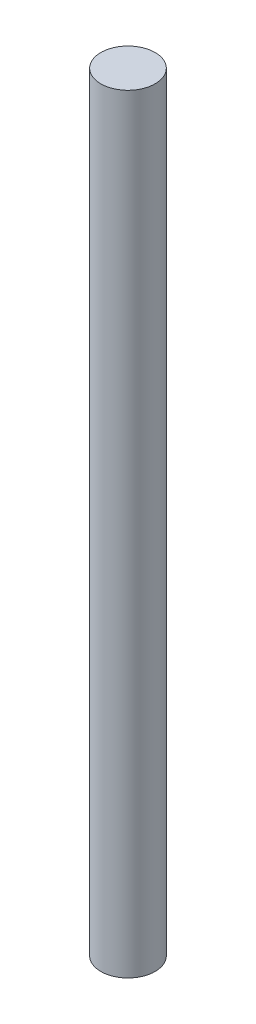
ISO-10303-21;
HEADER;
FILE_DESCRIPTION(('STEP AP214'),'2;1');
FILE_NAME('part.step','',(''),(''),'','','');
FILE_SCHEMA(('AUTOMOTIVE_DESIGN { 1 0 10303 214 1 1 1 1 }'));
ENDSEC;
DATA;
#1=APPLICATION_CONTEXT('core data for automotive mechanical design processes');
#2=APPLICATION_PROTOCOL_DEFINITION('international standard','automotive_design',2000,#1);
#3=PRODUCT_CONTEXT('',#1,'mechanical');
#4=PRODUCT('Part','Part','',(#3));
#5=PRODUCT_RELATED_PRODUCT_CATEGORY('part','',(#4));
#6=PRODUCT_DEFINITION_FORMATION('','',#4);
#7=PRODUCT_DEFINITION_CONTEXT('part definition',#1,'design');
#8=PRODUCT_DEFINITION('design','',#6,#7);
#9=PRODUCT_DEFINITION_SHAPE('','',#8);
#10=(LENGTH_UNIT() NAMED_UNIT(*) SI_UNIT(.MILLI.,.METRE.));
#11=(NAMED_UNIT(*) PLANE_ANGLE_UNIT() SI_UNIT($,.RADIAN.));
#12=(NAMED_UNIT(*) SI_UNIT($,.STERADIAN.) SOLID_ANGLE_UNIT());
#13=UNCERTAINTY_MEASURE_WITH_UNIT(LENGTH_MEASURE(1.E-05),#10,'distance_accuracy_value','');
#14=(GEOMETRIC_REPRESENTATION_CONTEXT(3) GLOBAL_UNCERTAINTY_ASSIGNED_CONTEXT((#13)) GLOBAL_UNIT_ASSIGNED_CONTEXT((#10,
#11,#12)) REPRESENTATION_CONTEXT('',''));
#15=CARTESIAN_POINT('',(0.,0.,0.));
#16=DIRECTION('',(0.,0.,1.));
#17=DIRECTION('',(1.,0.,0.));
#18=AXIS2_PLACEMENT_3D('',#15,#16,#17);
#19=CARTESIAN_POINT('',(0.,42.5,0.));
#20=DIRECTION('',(0.,-1.,0.));
#21=DIRECTION('',(0.,0.,-1.));
#22=AXIS2_PLACEMENT_3D('',#19,#20,#21);
#23=CYLINDRICAL_SURFACE('',#22,1.5);
#24=CARTESIAN_POINT('',(0.,42.5,0.));
#25=DIRECTION('',(0.,1.,0.));
#26=DIRECTION('',(0.,0.,1.));
#27=AXIS2_PLACEMENT_3D('',#24,#25,#26);
#28=CIRCLE('',#27,1.5);
#29=CARTESIAN_POINT('',(0.,42.5,1.5));
#30=VERTEX_POINT('',#29);
#31=EDGE_CURVE('E10',#30,#30,#28,.T.);
#32=ORIENTED_EDGE('',*,*,#31,.F.);
#33=EDGE_LOOP('',(#32));
#34=FACE_BOUND('',#33,.T.);
#35=CARTESIAN_POINT('',(0.,0.,0.));
#36=DIRECTION('',(0.,1.,0.));
#37=DIRECTION('',(0.,0.,1.));
#38=AXIS2_PLACEMENT_3D('',#35,#36,#37);
#39=CIRCLE('',#38,1.5);
#40=CARTESIAN_POINT('',(0.,0.,1.5));
#41=VERTEX_POINT('',#40);
#42=EDGE_CURVE('E34',#41,#41,#39,.T.);
#43=ORIENTED_EDGE('',*,*,#42,.T.);
#44=EDGE_LOOP('',(#43));
#45=FACE_BOUND('',#44,.T.);
#46=ADVANCED_FACE('F31',(#34,#45),#23,.T.);
#47=CARTESIAN_POINT('',(0.,42.5,0.));
#48=DIRECTION('',(0.,1.,0.));
#49=DIRECTION('',(0.,0.,1.));
#50=AXIS2_PLACEMENT_3D('',#47,#48,#49);
#51=PLANE('',#50);
#52=ORIENTED_EDGE('',*,*,#31,.T.);
#53=EDGE_LOOP('',(#52));
#54=FACE_BOUND('',#53,.T.);
#55=ADVANCED_FACE('F46',(#54),#51,.T.);
#56=CARTESIAN_POINT('',(0.,0.,0.));
#57=DIRECTION('',(0.,1.,0.));
#58=DIRECTION('',(0.,0.,1.));
#59=AXIS2_PLACEMENT_3D('',#56,#57,#58);
#60=PLANE('',#59);
#61=ORIENTED_EDGE('',*,*,#42,.F.);
#62=EDGE_LOOP('',(#61));
#63=FACE_BOUND('',#62,.T.);
#64=ADVANCED_FACE('F44',(#63),#60,.F.);
#65=CLOSED_SHELL('',(#46,#55,#64));
#66=MANIFOLD_SOLID_BREP('B2',#65);
#67=ADVANCED_BREP_SHAPE_REPRESENTATION('',(#18,#66),#14);
#68=SHAPE_DEFINITION_REPRESENTATION(#9,#67);
ENDSEC;
END-ISO-10303-21;
